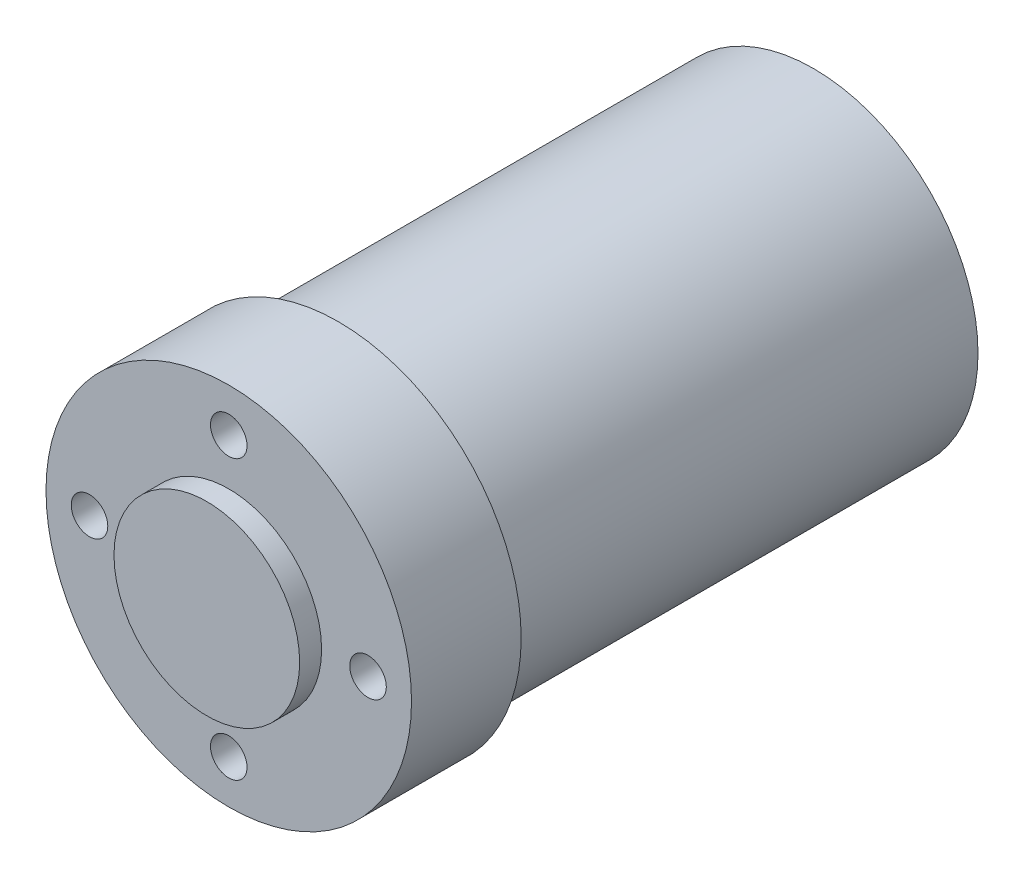
ISO-10303-21;
HEADER;
FILE_DESCRIPTION(('STEP AP214'),'2;1');
FILE_NAME('part.step','',(''),(''),'','','');
FILE_SCHEMA(('AUTOMOTIVE_DESIGN { 1 0 10303 214 1 1 1 1 }'));
ENDSEC;
DATA;
#1=APPLICATION_CONTEXT('core data for automotive mechanical design processes');
#2=APPLICATION_PROTOCOL_DEFINITION('international standard','automotive_design',2000,#1);
#3=PRODUCT_CONTEXT('',#1,'mechanical');
#4=PRODUCT('Part','Part','',(#3));
#5=PRODUCT_RELATED_PRODUCT_CATEGORY('part','',(#4));
#6=PRODUCT_DEFINITION_FORMATION('','',#4);
#7=PRODUCT_DEFINITION_CONTEXT('part definition',#1,'design');
#8=PRODUCT_DEFINITION('design','',#6,#7);
#9=PRODUCT_DEFINITION_SHAPE('','',#8);
#10=(LENGTH_UNIT() NAMED_UNIT(*) SI_UNIT(.MILLI.,.METRE.));
#11=(NAMED_UNIT(*) PLANE_ANGLE_UNIT() SI_UNIT($,.RADIAN.));
#12=(NAMED_UNIT(*) SI_UNIT($,.STERADIAN.) SOLID_ANGLE_UNIT());
#13=UNCERTAINTY_MEASURE_WITH_UNIT(LENGTH_MEASURE(1.E-05),#10,'distance_accuracy_value','');
#14=(GEOMETRIC_REPRESENTATION_CONTEXT(3) GLOBAL_UNCERTAINTY_ASSIGNED_CONTEXT((#13)) GLOBAL_UNIT_ASSIGNED_CONTEXT((#10,
#11,#12)) REPRESENTATION_CONTEXT('',''));
#15=CARTESIAN_POINT('',(0.,0.,0.));
#16=DIRECTION('',(0.,0.,1.));
#17=DIRECTION('',(1.,0.,0.));
#18=AXIS2_PLACEMENT_3D('',#15,#16,#17);
#19=CARTESIAN_POINT('',(0.,0.,80.));
#20=DIRECTION('',(0.,0.,-1.));
#21=DIRECTION('',(-1.,0.,0.));
#22=AXIS2_PLACEMENT_3D('',#19,#20,#21);
#23=CYLINDRICAL_SURFACE('',#22,25.);
#24=CARTESIAN_POINT('',(0.,0.,80.));
#25=DIRECTION('',(0.,0.,-1.));
#26=DIRECTION('',(-1.,0.,0.));
#27=AXIS2_PLACEMENT_3D('',#24,#25,#26);
#28=CIRCLE('',#27,25.);
#29=CARTESIAN_POINT('',(-25.,0.,80.));
#30=VERTEX_POINT('',#29);
#31=EDGE_CURVE('E10',#30,#30,#28,.T.);
#32=ORIENTED_EDGE('',*,*,#31,.T.);
#33=EDGE_LOOP('',(#32));
#34=FACE_BOUND('',#33,.T.);
#35=CARTESIAN_POINT('',(0.,0.,65.));
#36=DIRECTION('',(0.,0.,-1.));
#37=DIRECTION('',(-1.,0.,0.));
#38=AXIS2_PLACEMENT_3D('',#35,#36,#37);
#39=CIRCLE('',#38,25.);
#40=CARTESIAN_POINT('',(-25.,0.,65.));
#41=VERTEX_POINT('',#40);
#42=EDGE_CURVE('E36',#41,#41,#39,.T.);
#43=ORIENTED_EDGE('',*,*,#42,.F.);
#44=EDGE_LOOP('',(#43));
#45=FACE_BOUND('',#44,.T.);
#46=ADVANCED_FACE('F30',(#34,#45),#23,.T.);
#47=CARTESIAN_POINT('',(25.,0.,80.));
#48=DIRECTION('',(0.,0.,1.));
#49=DIRECTION('',(1.,0.,0.));
#50=AXIS2_PLACEMENT_3D('',#47,#48,#49);
#51=PLANE('',#50);
#52=CARTESIAN_POINT('',(-19.0499999999995,-5.41433564649196E-13,80.));
#53=DIRECTION('',(0.,0.,1.));
#54=DIRECTION('',(1.,0.,0.));
#55=AXIS2_PLACEMENT_3D('',#52,#53,#54);
#56=CIRCLE('',#55,2.50000000000086);
#57=CARTESIAN_POINT('',(-16.5499999999986,-5.41433564649196E-13,80.));
#58=VERTEX_POINT('',#57);
#59=EDGE_CURVE('E124',#58,#58,#56,.T.);
#60=ORIENTED_EDGE('',*,*,#59,.F.);
#61=EDGE_LOOP('',(#60));
#62=FACE_BOUND('',#61,.T.);
#63=CARTESIAN_POINT('',(1.07820122499364E-12,-19.05,80.));
#64=DIRECTION('',(0.,0.,1.));
#65=DIRECTION('',(1.,0.,0.));
#66=AXIS2_PLACEMENT_3D('',#63,#64,#65);
#67=CIRCLE('',#66,2.50000000000086);
#68=CARTESIAN_POINT('',(2.50000000000193,-19.05,80.));
#69=VERTEX_POINT('',#68);
#70=EDGE_CURVE('E118',#69,#69,#67,.T.);
#71=ORIENTED_EDGE('',*,*,#70,.F.);
#72=EDGE_LOOP('',(#71));
#73=FACE_BOUND('',#72,.T.);
#74=CARTESIAN_POINT('',(19.0500000000005,5.39100612496821E-13,80.));
#75=DIRECTION('',(0.,0.,1.));
#76=DIRECTION('',(1.,0.,0.));
#77=AXIS2_PLACEMENT_3D('',#74,#75,#76);
#78=CIRCLE('',#77,2.50000000000086);
#79=CARTESIAN_POINT('',(21.5500000000014,5.39100612496821E-13,80.));
#80=VERTEX_POINT('',#79);
#81=EDGE_CURVE('E112',#80,#80,#78,.T.);
#82=ORIENTED_EDGE('',*,*,#81,.F.);
#83=EDGE_LOOP('',(#82));
#84=FACE_BOUND('',#83,.T.);
#85=CARTESIAN_POINT('',(0.,19.05,80.));
#86=DIRECTION('',(0.,0.,1.));
#87=DIRECTION('',(1.,0.,0.));
#88=AXIS2_PLACEMENT_3D('',#85,#86,#87);
#89=CIRCLE('',#88,2.50000000000086);
#90=CARTESIAN_POINT('',(2.50000000000086,19.05,80.));
#91=VERTEX_POINT('',#90);
#92=EDGE_CURVE('E106',#91,#91,#89,.T.);
#93=ORIENTED_EDGE('',*,*,#92,.F.);
#94=EDGE_LOOP('',(#93));
#95=FACE_BOUND('',#94,.T.);
#96=CARTESIAN_POINT('',(0.,0.,80.));
#97=DIRECTION('',(0.,0.,1.));
#98=DIRECTION('',(1.,0.,0.));
#99=AXIS2_PLACEMENT_3D('',#96,#97,#98);
#100=CIRCLE('',#99,12.7);
#101=CARTESIAN_POINT('',(12.7,0.,80.));
#102=VERTEX_POINT('',#101);
#103=EDGE_CURVE('E44',#102,#102,#100,.T.);
#104=ORIENTED_EDGE('',*,*,#103,.F.);
#105=EDGE_LOOP('',(#104));
#106=FACE_BOUND('',#105,.T.);
#107=ORIENTED_EDGE('',*,*,#31,.F.);
#108=EDGE_LOOP('',(#107));
#109=FACE_BOUND('',#108,.T.);
#110=ADVANCED_FACE('F130',(#62,#73,#84,#95,#106,#109),#51,.T.);
#111=CARTESIAN_POINT('',(0.,0.,65.));
#112=DIRECTION('',(0.,0.,-1.));
#113=DIRECTION('',(-1.,0.,0.));
#114=AXIS2_PLACEMENT_3D('',#111,#112,#113);
#115=PLANE('',#114);
#116=CARTESIAN_POINT('',(0.,0.,65.));
#117=DIRECTION('',(0.,0.,-1.));
#118=DIRECTION('',(-1.,0.,0.));
#119=AXIS2_PLACEMENT_3D('',#116,#117,#118);
#120=CIRCLE('',#119,22.4917);
#121=CARTESIAN_POINT('',(-22.4917,0.,65.));
#122=VERTEX_POINT('',#121);
#123=EDGE_CURVE('E50',#122,#122,#120,.T.);
#124=ORIENTED_EDGE('',*,*,#123,.F.);
#125=EDGE_LOOP('',(#124));
#126=FACE_BOUND('',#125,.T.);
#127=ORIENTED_EDGE('',*,*,#42,.T.);
#128=EDGE_LOOP('',(#127));
#129=FACE_BOUND('',#128,.T.);
#130=ADVANCED_FACE('F133',(#126,#129),#115,.T.);
#131=CARTESIAN_POINT('',(0.,0.,83.));
#132=DIRECTION('',(0.,0.,-1.));
#133=DIRECTION('',(-1.,0.,0.));
#134=AXIS2_PLACEMENT_3D('',#131,#132,#133);
#135=CYLINDRICAL_SURFACE('',#134,12.7);
#136=CARTESIAN_POINT('',(0.,0.,83.));
#137=DIRECTION('',(0.,0.,1.));
#138=DIRECTION('',(1.,0.,0.));
#139=AXIS2_PLACEMENT_3D('',#136,#137,#138);
#140=CIRCLE('',#139,12.7);
#141=CARTESIAN_POINT('',(12.7,0.,83.));
#142=VERTEX_POINT('',#141);
#143=EDGE_CURVE('E40',#142,#142,#140,.T.);
#144=ORIENTED_EDGE('',*,*,#143,.F.);
#145=EDGE_LOOP('',(#144));
#146=FACE_BOUND('',#145,.T.);
#147=ORIENTED_EDGE('',*,*,#103,.T.);
#148=EDGE_LOOP('',(#147));
#149=FACE_BOUND('',#148,.T.);
#150=ADVANCED_FACE('F143',(#146,#149),#135,.T.);
#151=CARTESIAN_POINT('',(0.,0.,83.));
#152=DIRECTION('',(0.,0.,1.));
#153=DIRECTION('',(1.,0.,0.));
#154=AXIS2_PLACEMENT_3D('',#151,#152,#153);
#155=PLANE('',#154);
#156=ORIENTED_EDGE('',*,*,#143,.T.);
#157=EDGE_LOOP('',(#156));
#158=FACE_BOUND('',#157,.T.);
#159=ADVANCED_FACE('F145',(#158),#155,.T.);
#160=CARTESIAN_POINT('',(0.,0.,0.));
#161=DIRECTION('',(0.,0.,1.));
#162=DIRECTION('',(1.,0.,0.));
#163=AXIS2_PLACEMENT_3D('',#160,#161,#162);
#164=CYLINDRICAL_SURFACE('',#163,22.4917);
#165=CARTESIAN_POINT('',(0.,0.,0.));
#166=DIRECTION('',(0.,0.,-1.));
#167=DIRECTION('',(-1.,0.,0.));
#168=AXIS2_PLACEMENT_3D('',#165,#166,#167);
#169=CIRCLE('',#168,22.4917);
#170=CARTESIAN_POINT('',(-22.4917,0.,0.));
#171=VERTEX_POINT('',#170);
#172=EDGE_CURVE('E48',#171,#171,#169,.T.);
#173=ORIENTED_EDGE('',*,*,#172,.F.);
#174=EDGE_LOOP('',(#173));
#175=FACE_BOUND('',#174,.T.);
#176=ORIENTED_EDGE('',*,*,#123,.T.);
#177=EDGE_LOOP('',(#176));
#178=FACE_BOUND('',#177,.T.);
#179=ADVANCED_FACE('F152',(#175,#178),#164,.T.);
#180=CARTESIAN_POINT('',(0.,0.,0.));
#181=DIRECTION('',(0.,0.,-1.));
#182=DIRECTION('',(-1.,0.,0.));
#183=AXIS2_PLACEMENT_3D('',#180,#181,#182);
#184=PLANE('',#183);
#185=CARTESIAN_POINT('',(12.3743686707641,12.3743686707635,0.));
#186=DIRECTION('',(0.,0.,-1.));
#187=DIRECTION('',(-1.,0.,0.));
#188=AXIS2_PLACEMENT_3D('',#185,#186,#187);
#189=CIRCLE('',#188,2.49999999999999);
#190=CARTESIAN_POINT('',(9.87436867076416,12.3743686707635,0.));
#191=VERTEX_POINT('',#190);
#192=EDGE_CURVE('E100',#191,#191,#189,.T.);
#193=ORIENTED_EDGE('',*,*,#192,.F.);
#194=EDGE_LOOP('',(#193));
#195=FACE_BOUND('',#194,.T.);
#196=CARTESIAN_POINT('',(17.4999999999985,-1.49213974509621E-12,0.));
#197=DIRECTION('',(0.,0.,-1.));
#198=DIRECTION('',(-1.,0.,0.));
#199=AXIS2_PLACEMENT_3D('',#196,#197,#198);
#200=CIRCLE('',#199,2.49999999999999);
#201=CARTESIAN_POINT('',(14.9999999999985,-1.49213974509621E-12,0.));
#202=VERTEX_POINT('',#201);
#203=EDGE_CURVE('E94',#202,#202,#200,.T.);
#204=ORIENTED_EDGE('',*,*,#203,.F.);
#205=EDGE_LOOP('',(#204));
#206=FACE_BOUND('',#205,.T.);
#207=CARTESIAN_POINT('',(12.374368670762,-12.3743686707656,0.));
#208=DIRECTION('',(0.,0.,-1.));
#209=DIRECTION('',(-1.,0.,0.));
#210=AXIS2_PLACEMENT_3D('',#207,#208,#209);
#211=CIRCLE('',#210,2.49999999999999);
#212=CARTESIAN_POINT('',(9.87436867076205,-12.3743686707656,0.));
#213=VERTEX_POINT('',#212);
#214=EDGE_CURVE('E88',#213,#213,#211,.T.);
#215=ORIENTED_EDGE('',*,*,#214,.F.);
#216=EDGE_LOOP('',(#215));
#217=FACE_BOUND('',#216,.T.);
#218=CARTESIAN_POINT('',(-2.97999322639541E-12,-17.5,0.));
#219=DIRECTION('',(0.,0.,-1.));
#220=DIRECTION('',(-1.,0.,0.));
#221=AXIS2_PLACEMENT_3D('',#218,#219,#220);
#222=CIRCLE('',#221,2.49999999999999);
#223=CARTESIAN_POINT('',(-2.50000000000297,-17.5,0.));
#224=VERTEX_POINT('',#223);
#225=EDGE_CURVE('E82',#224,#224,#222,.T.);
#226=ORIENTED_EDGE('',*,*,#225,.F.);
#227=EDGE_LOOP('',(#226));
#228=FACE_BOUND('',#227,.T.);
#229=CARTESIAN_POINT('',(-12.3743686707671,-12.3743686707635,0.));
#230=DIRECTION('',(0.,0.,-1.));
#231=DIRECTION('',(-1.,0.,0.));
#232=AXIS2_PLACEMENT_3D('',#229,#230,#231);
#233=CIRCLE('',#232,2.49999999999999);
#234=CARTESIAN_POINT('',(-14.8743686707671,-12.3743686707635,0.));
#235=VERTEX_POINT('',#234);
#236=EDGE_CURVE('E76',#235,#235,#233,.T.);
#237=ORIENTED_EDGE('',*,*,#236,.F.);
#238=EDGE_LOOP('',(#237));
#239=FACE_BOUND('',#238,.T.);
#240=CARTESIAN_POINT('',(-17.5000000000015,1.4899966131977E-12,0.));
#241=DIRECTION('',(0.,0.,-1.));
#242=DIRECTION('',(-1.,0.,0.));
#243=AXIS2_PLACEMENT_3D('',#240,#241,#242);
#244=CIRCLE('',#243,2.49999999999999);
#245=CARTESIAN_POINT('',(-20.0000000000015,1.4899966131977E-12,0.));
#246=VERTEX_POINT('',#245);
#247=EDGE_CURVE('E70',#246,#246,#244,.T.);
#248=ORIENTED_EDGE('',*,*,#247,.F.);
#249=EDGE_LOOP('',(#248));
#250=FACE_BOUND('',#249,.T.);
#251=CARTESIAN_POINT('',(-12.374368670765,12.3743686707656,0.));
#252=DIRECTION('',(0.,0.,-1.));
#253=DIRECTION('',(-1.,0.,0.));
#254=AXIS2_PLACEMENT_3D('',#251,#252,#253);
#255=CIRCLE('',#254,2.49999999999999);
#256=CARTESIAN_POINT('',(-14.874368670765,12.3743686707656,0.));
#257=VERTEX_POINT('',#256);
#258=EDGE_CURVE('E64',#257,#257,#255,.T.);
#259=ORIENTED_EDGE('',*,*,#258,.F.);
#260=EDGE_LOOP('',(#259));
#261=FACE_BOUND('',#260,.T.);
#262=CARTESIAN_POINT('',(0.,17.5,0.));
#263=DIRECTION('',(0.,0.,-1.));
#264=DIRECTION('',(-1.,0.,0.));
#265=AXIS2_PLACEMENT_3D('',#262,#263,#264);
#266=CIRCLE('',#265,2.49999999999999);
#267=CARTESIAN_POINT('',(-2.49999999999999,17.5,0.));
#268=VERTEX_POINT('',#267);
#269=EDGE_CURVE('E58',#268,#268,#266,.T.);
#270=ORIENTED_EDGE('',*,*,#269,.F.);
#271=EDGE_LOOP('',(#270));
#272=FACE_BOUND('',#271,.T.);
#273=ORIENTED_EDGE('',*,*,#172,.T.);
#274=EDGE_LOOP('',(#273));
#275=FACE_BOUND('',#274,.T.);
#276=ADVANCED_FACE('F185',(#195,#206,#217,#228,#239,#250,#261,#272,#275),#184,.T.);
#277=CARTESIAN_POINT('',(0.,17.5,7.99999999999999));
#278=DIRECTION('',(0.,0.,1.));
#279=DIRECTION('',(1.,0.,0.));
#280=AXIS2_PLACEMENT_3D('',#277,#278,#279);
#281=PLANE('',#280);
#282=CARTESIAN_POINT('',(0.,17.5,7.99999999999999));
#283=DIRECTION('',(0.,0.,-1.));
#284=DIRECTION('',(-1.,0.,0.));
#285=AXIS2_PLACEMENT_3D('',#282,#283,#284);
#286=CIRCLE('',#285,2.49999999999999);
#287=CARTESIAN_POINT('',(-2.49999999999999,17.5,7.99999999999999));
#288=VERTEX_POINT('',#287);
#289=EDGE_CURVE('E53',#288,#288,#286,.T.);
#290=ORIENTED_EDGE('',*,*,#289,.T.);
#291=EDGE_LOOP('',(#290));
#292=FACE_BOUND('',#291,.T.);
#293=ADVANCED_FACE('F195',(#292),#281,.F.);
#294=CARTESIAN_POINT('',(0.,17.5,0.));
#295=DIRECTION('',(0.,0.,-1.));
#296=DIRECTION('',(-1.,0.,0.));
#297=AXIS2_PLACEMENT_3D('',#294,#295,#296);
#298=CYLINDRICAL_SURFACE('',#297,2.49999999999999);
#299=ORIENTED_EDGE('',*,*,#289,.F.);
#300=EDGE_LOOP('',(#299));
#301=FACE_BOUND('',#300,.T.);
#302=ORIENTED_EDGE('',*,*,#269,.T.);
#303=EDGE_LOOP('',(#302));
#304=FACE_BOUND('',#303,.T.);
#305=ADVANCED_FACE('F205',(#301,#304),#298,.F.);
#306=CARTESIAN_POINT('',(-12.374368670765,12.3743686707656,7.99999999999999));
#307=DIRECTION('',(0.,0.,1.));
#308=DIRECTION('',(1.,0.,0.));
#309=AXIS2_PLACEMENT_3D('',#306,#307,#308);
#310=PLANE('',#309);
#311=CARTESIAN_POINT('',(-12.374368670765,12.3743686707656,7.99999999999999));
#312=DIRECTION('',(0.,0.,-1.));
#313=DIRECTION('',(-1.,0.,0.));
#314=AXIS2_PLACEMENT_3D('',#311,#312,#313);
#315=CIRCLE('',#314,2.49999999999999);
#316=CARTESIAN_POINT('',(-14.874368670765,12.3743686707656,7.99999999999999));
#317=VERTEX_POINT('',#316);
#318=EDGE_CURVE('E61',#317,#317,#315,.T.);
#319=ORIENTED_EDGE('',*,*,#318,.T.);
#320=EDGE_LOOP('',(#319));
#321=FACE_BOUND('',#320,.T.);
#322=ADVANCED_FACE('F215',(#321),#310,.F.);
#323=CARTESIAN_POINT('',(-12.374368670765,12.3743686707656,0.));
#324=DIRECTION('',(0.,0.,-1.));
#325=DIRECTION('',(-1.,0.,0.));
#326=AXIS2_PLACEMENT_3D('',#323,#324,#325);
#327=CYLINDRICAL_SURFACE('',#326,2.49999999999999);
#328=ORIENTED_EDGE('',*,*,#318,.F.);
#329=EDGE_LOOP('',(#328));
#330=FACE_BOUND('',#329,.T.);
#331=ORIENTED_EDGE('',*,*,#258,.T.);
#332=EDGE_LOOP('',(#331));
#333=FACE_BOUND('',#332,.T.);
#334=ADVANCED_FACE('F225',(#330,#333),#327,.F.);
#335=CARTESIAN_POINT('',(-17.5000000000015,1.4899966131977E-12,7.99999999999999));
#336=DIRECTION('',(0.,0.,1.));
#337=DIRECTION('',(1.,0.,0.));
#338=AXIS2_PLACEMENT_3D('',#335,#336,#337);
#339=PLANE('',#338);
#340=CARTESIAN_POINT('',(-17.5000000000015,1.4899966131977E-12,7.99999999999999));
#341=DIRECTION('',(0.,0.,-1.));
#342=DIRECTION('',(-1.,0.,0.));
#343=AXIS2_PLACEMENT_3D('',#340,#341,#342);
#344=CIRCLE('',#343,2.49999999999999);
#345=CARTESIAN_POINT('',(-20.0000000000015,1.4899966131977E-12,7.99999999999999));
#346=VERTEX_POINT('',#345);
#347=EDGE_CURVE('E67',#346,#346,#344,.T.);
#348=ORIENTED_EDGE('',*,*,#347,.T.);
#349=EDGE_LOOP('',(#348));
#350=FACE_BOUND('',#349,.T.);
#351=ADVANCED_FACE('F235',(#350),#339,.F.);
#352=CARTESIAN_POINT('',(-17.5000000000015,1.4899966131977E-12,0.));
#353=DIRECTION('',(0.,0.,-1.));
#354=DIRECTION('',(-1.,0.,0.));
#355=AXIS2_PLACEMENT_3D('',#352,#353,#354);
#356=CYLINDRICAL_SURFACE('',#355,2.49999999999999);
#357=ORIENTED_EDGE('',*,*,#347,.F.);
#358=EDGE_LOOP('',(#357));
#359=FACE_BOUND('',#358,.T.);
#360=ORIENTED_EDGE('',*,*,#247,.T.);
#361=EDGE_LOOP('',(#360));
#362=FACE_BOUND('',#361,.T.);
#363=ADVANCED_FACE('F245',(#359,#362),#356,.F.);
#364=CARTESIAN_POINT('',(-12.3743686707671,-12.3743686707635,7.99999999999999));
#365=DIRECTION('',(0.,0.,1.));
#366=DIRECTION('',(1.,0.,0.));
#367=AXIS2_PLACEMENT_3D('',#364,#365,#366);
#368=PLANE('',#367);
#369=CARTESIAN_POINT('',(-12.3743686707671,-12.3743686707635,7.99999999999999));
#370=DIRECTION('',(0.,0.,-1.));
#371=DIRECTION('',(-1.,0.,0.));
#372=AXIS2_PLACEMENT_3D('',#369,#370,#371);
#373=CIRCLE('',#372,2.49999999999999);
#374=CARTESIAN_POINT('',(-14.8743686707671,-12.3743686707635,7.99999999999999));
#375=VERTEX_POINT('',#374);
#376=EDGE_CURVE('E73',#375,#375,#373,.T.);
#377=ORIENTED_EDGE('',*,*,#376,.T.);
#378=EDGE_LOOP('',(#377));
#379=FACE_BOUND('',#378,.T.);
#380=ADVANCED_FACE('F255',(#379),#368,.F.);
#381=CARTESIAN_POINT('',(-12.3743686707671,-12.3743686707635,0.));
#382=DIRECTION('',(0.,0.,-1.));
#383=DIRECTION('',(-1.,0.,0.));
#384=AXIS2_PLACEMENT_3D('',#381,#382,#383);
#385=CYLINDRICAL_SURFACE('',#384,2.49999999999999);
#386=ORIENTED_EDGE('',*,*,#376,.F.);
#387=EDGE_LOOP('',(#386));
#388=FACE_BOUND('',#387,.T.);
#389=ORIENTED_EDGE('',*,*,#236,.T.);
#390=EDGE_LOOP('',(#389));
#391=FACE_BOUND('',#390,.T.);
#392=ADVANCED_FACE('F265',(#388,#391),#385,.F.);
#393=CARTESIAN_POINT('',(-2.98195266127404E-12,-17.5,7.99999999999999));
#394=DIRECTION('',(0.,0.,1.));
#395=DIRECTION('',(1.,0.,0.));
#396=AXIS2_PLACEMENT_3D('',#393,#394,#395);
#397=PLANE('',#396);
#398=CARTESIAN_POINT('',(-2.97999322639541E-12,-17.5,7.99999999999999));
#399=DIRECTION('',(0.,0.,-1.));
#400=DIRECTION('',(-1.,0.,0.));
#401=AXIS2_PLACEMENT_3D('',#398,#399,#400);
#402=CIRCLE('',#401,2.49999999999999);
#403=CARTESIAN_POINT('',(-2.50000000000297,-17.5,7.99999999999999));
#404=VERTEX_POINT('',#403);
#405=EDGE_CURVE('E79',#404,#404,#402,.T.);
#406=ORIENTED_EDGE('',*,*,#405,.T.);
#407=EDGE_LOOP('',(#406));
#408=FACE_BOUND('',#407,.T.);
#409=ADVANCED_FACE('F275',(#408),#397,.F.);
#410=CARTESIAN_POINT('',(-2.97999322639541E-12,-17.5,0.));
#411=DIRECTION('',(0.,0.,-1.));
#412=DIRECTION('',(-1.,0.,0.));
#413=AXIS2_PLACEMENT_3D('',#410,#411,#412);
#414=CYLINDRICAL_SURFACE('',#413,2.49999999999999);
#415=ORIENTED_EDGE('',*,*,#405,.F.);
#416=EDGE_LOOP('',(#415));
#417=FACE_BOUND('',#416,.T.);
#418=ORIENTED_EDGE('',*,*,#225,.T.);
#419=EDGE_LOOP('',(#418));
#420=FACE_BOUND('',#419,.T.);
#421=ADVANCED_FACE('F285',(#417,#420),#414,.F.);
#422=CARTESIAN_POINT('',(12.374368670762,-12.3743686707656,7.99999999999999));
#423=DIRECTION('',(0.,0.,1.));
#424=DIRECTION('',(1.,0.,0.));
#425=AXIS2_PLACEMENT_3D('',#422,#423,#424);
#426=PLANE('',#425);
#427=CARTESIAN_POINT('',(12.374368670762,-12.3743686707656,7.99999999999999));
#428=DIRECTION('',(0.,0.,-1.));
#429=DIRECTION('',(-1.,0.,0.));
#430=AXIS2_PLACEMENT_3D('',#427,#428,#429);
#431=CIRCLE('',#430,2.49999999999999);
#432=CARTESIAN_POINT('',(9.87436867076205,-12.3743686707656,7.99999999999999));
#433=VERTEX_POINT('',#432);
#434=EDGE_CURVE('E85',#433,#433,#431,.T.);
#435=ORIENTED_EDGE('',*,*,#434,.T.);
#436=EDGE_LOOP('',(#435));
#437=FACE_BOUND('',#436,.T.);
#438=ADVANCED_FACE('F295',(#437),#426,.F.);
#439=CARTESIAN_POINT('',(12.374368670762,-12.3743686707656,0.));
#440=DIRECTION('',(0.,0.,-1.));
#441=DIRECTION('',(-1.,0.,0.));
#442=AXIS2_PLACEMENT_3D('',#439,#440,#441);
#443=CYLINDRICAL_SURFACE('',#442,2.49999999999999);
#444=ORIENTED_EDGE('',*,*,#434,.F.);
#445=EDGE_LOOP('',(#444));
#446=FACE_BOUND('',#445,.T.);
#447=ORIENTED_EDGE('',*,*,#214,.T.);
#448=EDGE_LOOP('',(#447));
#449=FACE_BOUND('',#448,.T.);
#450=ADVANCED_FACE('F305',(#446,#449),#443,.F.);
#451=CARTESIAN_POINT('',(17.4999999999985,-1.49213974509621E-12,7.99999999999999));
#452=DIRECTION('',(0.,0.,1.));
#453=DIRECTION('',(1.,0.,0.));
#454=AXIS2_PLACEMENT_3D('',#451,#452,#453);
#455=PLANE('',#454);
#456=CARTESIAN_POINT('',(17.4999999999985,-1.49213974509621E-12,7.99999999999999));
#457=DIRECTION('',(0.,0.,-1.));
#458=DIRECTION('',(-1.,0.,0.));
#459=AXIS2_PLACEMENT_3D('',#456,#457,#458);
#460=CIRCLE('',#459,2.49999999999999);
#461=CARTESIAN_POINT('',(14.9999999999985,-1.49213974509621E-12,7.99999999999999));
#462=VERTEX_POINT('',#461);
#463=EDGE_CURVE('E91',#462,#462,#460,.T.);
#464=ORIENTED_EDGE('',*,*,#463,.T.);
#465=EDGE_LOOP('',(#464));
#466=FACE_BOUND('',#465,.T.);
#467=ADVANCED_FACE('F315',(#466),#455,.F.);
#468=CARTESIAN_POINT('',(17.4999999999985,-1.49213974509621E-12,0.));
#469=DIRECTION('',(0.,0.,-1.));
#470=DIRECTION('',(-1.,0.,0.));
#471=AXIS2_PLACEMENT_3D('',#468,#469,#470);
#472=CYLINDRICAL_SURFACE('',#471,2.49999999999999);
#473=ORIENTED_EDGE('',*,*,#463,.F.);
#474=EDGE_LOOP('',(#473));
#475=FACE_BOUND('',#474,.T.);
#476=ORIENTED_EDGE('',*,*,#203,.T.);
#477=EDGE_LOOP('',(#476));
#478=FACE_BOUND('',#477,.T.);
#479=ADVANCED_FACE('F325',(#475,#478),#472,.F.);
#480=CARTESIAN_POINT('',(12.3743686707641,12.3743686707635,7.99999999999999));
#481=DIRECTION('',(0.,0.,1.));
#482=DIRECTION('',(1.,0.,0.));
#483=AXIS2_PLACEMENT_3D('',#480,#481,#482);
#484=PLANE('',#483);
#485=CARTESIAN_POINT('',(12.3743686707641,12.3743686707635,7.99999999999999));
#486=DIRECTION('',(0.,0.,-1.));
#487=DIRECTION('',(-1.,0.,0.));
#488=AXIS2_PLACEMENT_3D('',#485,#486,#487);
#489=CIRCLE('',#488,2.49999999999999);
#490=CARTESIAN_POINT('',(9.87436867076416,12.3743686707635,7.99999999999999));
#491=VERTEX_POINT('',#490);
#492=EDGE_CURVE('E97',#491,#491,#489,.T.);
#493=ORIENTED_EDGE('',*,*,#492,.T.);
#494=EDGE_LOOP('',(#493));
#495=FACE_BOUND('',#494,.T.);
#496=ADVANCED_FACE('F335',(#495),#484,.F.);
#497=CARTESIAN_POINT('',(12.3743686707641,12.3743686707635,0.));
#498=DIRECTION('',(0.,0.,-1.));
#499=DIRECTION('',(-1.,0.,0.));
#500=AXIS2_PLACEMENT_3D('',#497,#498,#499);
#501=CYLINDRICAL_SURFACE('',#500,2.49999999999999);
#502=ORIENTED_EDGE('',*,*,#492,.F.);
#503=EDGE_LOOP('',(#502));
#504=FACE_BOUND('',#503,.T.);
#505=ORIENTED_EDGE('',*,*,#192,.T.);
#506=EDGE_LOOP('',(#505));
#507=FACE_BOUND('',#506,.T.);
#508=ADVANCED_FACE('F344',(#504,#507),#501,.F.);
#509=CARTESIAN_POINT('',(0.,19.05,67.554));
#510=DIRECTION('',(0.,0.,-1.));
#511=DIRECTION('',(-1.,0.,0.));
#512=AXIS2_PLACEMENT_3D('',#509,#510,#511);
#513=PLANE('',#512);
#514=CARTESIAN_POINT('',(0.,19.05,67.554));
#515=DIRECTION('',(0.,0.,1.));
#516=DIRECTION('',(1.,0.,0.));
#517=AXIS2_PLACEMENT_3D('',#514,#515,#516);
#518=CIRCLE('',#517,2.50000000000085);
#519=CARTESIAN_POINT('',(2.50000000000085,19.05,67.554));
#520=VERTEX_POINT('',#519);
#521=EDGE_CURVE('E103',#520,#520,#518,.T.);
#522=ORIENTED_EDGE('',*,*,#521,.T.);
#523=EDGE_LOOP('',(#522));
#524=FACE_BOUND('',#523,.T.);
#525=ADVANCED_FACE('F353',(#524),#513,.F.);
#526=CARTESIAN_POINT('',(0.,19.05,80.));
#527=DIRECTION('',(0.,0.,1.));
#528=DIRECTION('',(1.,0.,0.));
#529=AXIS2_PLACEMENT_3D('',#526,#527,#528);
#530=CYLINDRICAL_SURFACE('',#529,2.50000000000085);
#531=ORIENTED_EDGE('',*,*,#521,.F.);
#532=EDGE_LOOP('',(#531));
#533=FACE_BOUND('',#532,.T.);
#534=ORIENTED_EDGE('',*,*,#92,.T.);
#535=EDGE_LOOP('',(#534));
#536=FACE_BOUND('',#535,.T.);
#537=ADVANCED_FACE('F363',(#533,#536),#530,.F.);
#538=CARTESIAN_POINT('',(19.0500000000005,5.39100612496821E-13,67.554));
#539=DIRECTION('',(0.,0.,-1.));
#540=DIRECTION('',(-1.,0.,0.));
#541=AXIS2_PLACEMENT_3D('',#538,#539,#540);
#542=PLANE('',#541);
#543=CARTESIAN_POINT('',(19.0500000000005,5.39100612496821E-13,67.554));
#544=DIRECTION('',(0.,0.,1.));
#545=DIRECTION('',(1.,0.,0.));
#546=AXIS2_PLACEMENT_3D('',#543,#544,#545);
#547=CIRCLE('',#546,2.50000000000086);
#548=CARTESIAN_POINT('',(21.5500000000014,5.39100612496821E-13,67.554));
#549=VERTEX_POINT('',#548);
#550=EDGE_CURVE('E109',#549,#549,#547,.T.);
#551=ORIENTED_EDGE('',*,*,#550,.T.);
#552=EDGE_LOOP('',(#551));
#553=FACE_BOUND('',#552,.T.);
#554=ADVANCED_FACE('F370',(#553),#542,.F.);
#555=CARTESIAN_POINT('',(19.0500000000005,5.39100612496821E-13,80.));
#556=DIRECTION('',(0.,0.,1.));
#557=DIRECTION('',(1.,0.,0.));
#558=AXIS2_PLACEMENT_3D('',#555,#556,#557);
#559=CYLINDRICAL_SURFACE('',#558,2.50000000000086);
#560=ORIENTED_EDGE('',*,*,#550,.F.);
#561=EDGE_LOOP('',(#560));
#562=FACE_BOUND('',#561,.T.);
#563=ORIENTED_EDGE('',*,*,#81,.T.);
#564=EDGE_LOOP('',(#563));
#565=FACE_BOUND('',#564,.T.);
#566=ADVANCED_FACE('F378',(#562,#565),#559,.F.);
#567=CARTESIAN_POINT('',(1.0751528341812E-12,-19.05,67.554));
#568=DIRECTION('',(0.,0.,-1.));
#569=DIRECTION('',(-1.,0.,0.));
#570=AXIS2_PLACEMENT_3D('',#567,#568,#569);
#571=PLANE('',#570);
#572=CARTESIAN_POINT('',(1.07820122499364E-12,-19.05,67.554));
#573=DIRECTION('',(0.,0.,1.));
#574=DIRECTION('',(1.,0.,0.));
#575=AXIS2_PLACEMENT_3D('',#572,#573,#574);
#576=CIRCLE('',#575,2.50000000000085);
#577=CARTESIAN_POINT('',(2.50000000000193,-19.05,67.554));
#578=VERTEX_POINT('',#577);
#579=EDGE_CURVE('E115',#578,#578,#576,.T.);
#580=ORIENTED_EDGE('',*,*,#579,.T.);
#581=EDGE_LOOP('',(#580));
#582=FACE_BOUND('',#581,.T.);
#583=ADVANCED_FACE('F386',(#582),#571,.F.);
#584=CARTESIAN_POINT('',(1.07820122499364E-12,-19.05,80.));
#585=DIRECTION('',(0.,0.,1.));
#586=DIRECTION('',(1.,0.,0.));
#587=AXIS2_PLACEMENT_3D('',#584,#585,#586);
#588=CYLINDRICAL_SURFACE('',#587,2.50000000000085);
#589=ORIENTED_EDGE('',*,*,#579,.F.);
#590=EDGE_LOOP('',(#589));
#591=FACE_BOUND('',#590,.T.);
#592=ORIENTED_EDGE('',*,*,#70,.T.);
#593=EDGE_LOOP('',(#592));
#594=FACE_BOUND('',#593,.T.);
#595=ADVANCED_FACE('F394',(#591,#594),#588,.F.);
#596=CARTESIAN_POINT('',(-19.0499999999995,-5.41433564649196E-13,67.554));
#597=DIRECTION('',(0.,0.,-1.));
#598=DIRECTION('',(-1.,0.,0.));
#599=AXIS2_PLACEMENT_3D('',#596,#597,#598);
#600=PLANE('',#599);
#601=CARTESIAN_POINT('',(-19.0499999999995,-5.41433564649196E-13,67.554));
#602=DIRECTION('',(0.,0.,1.));
#603=DIRECTION('',(1.,0.,0.));
#604=AXIS2_PLACEMENT_3D('',#601,#602,#603);
#605=CIRCLE('',#604,2.50000000000086);
#606=CARTESIAN_POINT('',(-16.5499999999986,-5.41433564649196E-13,67.554));
#607=VERTEX_POINT('',#606);
#608=EDGE_CURVE('E121',#607,#607,#605,.T.);
#609=ORIENTED_EDGE('',*,*,#608,.T.);
#610=EDGE_LOOP('',(#609));
#611=FACE_BOUND('',#610,.T.);
#612=ADVANCED_FACE('F402',(#611),#600,.F.);
#613=CARTESIAN_POINT('',(-19.0499999999995,-5.41433564649196E-13,80.));
#614=DIRECTION('',(0.,0.,1.));
#615=DIRECTION('',(1.,0.,0.));
#616=AXIS2_PLACEMENT_3D('',#613,#614,#615);
#617=CYLINDRICAL_SURFACE('',#616,2.50000000000086);
#618=ORIENTED_EDGE('',*,*,#608,.F.);
#619=EDGE_LOOP('',(#618));
#620=FACE_BOUND('',#619,.T.);
#621=ORIENTED_EDGE('',*,*,#59,.T.);
#622=EDGE_LOOP('',(#621));
#623=FACE_BOUND('',#622,.T.);
#624=ADVANCED_FACE('F128',(#620,#623),#617,.F.);
#625=CLOSED_SHELL('',(#46,#110,#130,#150,#159,#179,#276,#293,#305,#322,#334,#351,#363,#380,#392,
#409,#421,#438,#450,#467,#479,#496,#508,#525,#537,#554,#566,#583,#595,#612,#624));
#626=MANIFOLD_SOLID_BREP('B2',#625);
#627=ADVANCED_BREP_SHAPE_REPRESENTATION('',(#18,#626),#14);
#628=SHAPE_DEFINITION_REPRESENTATION(#9,#627);
ENDSEC;
END-ISO-10303-21;
